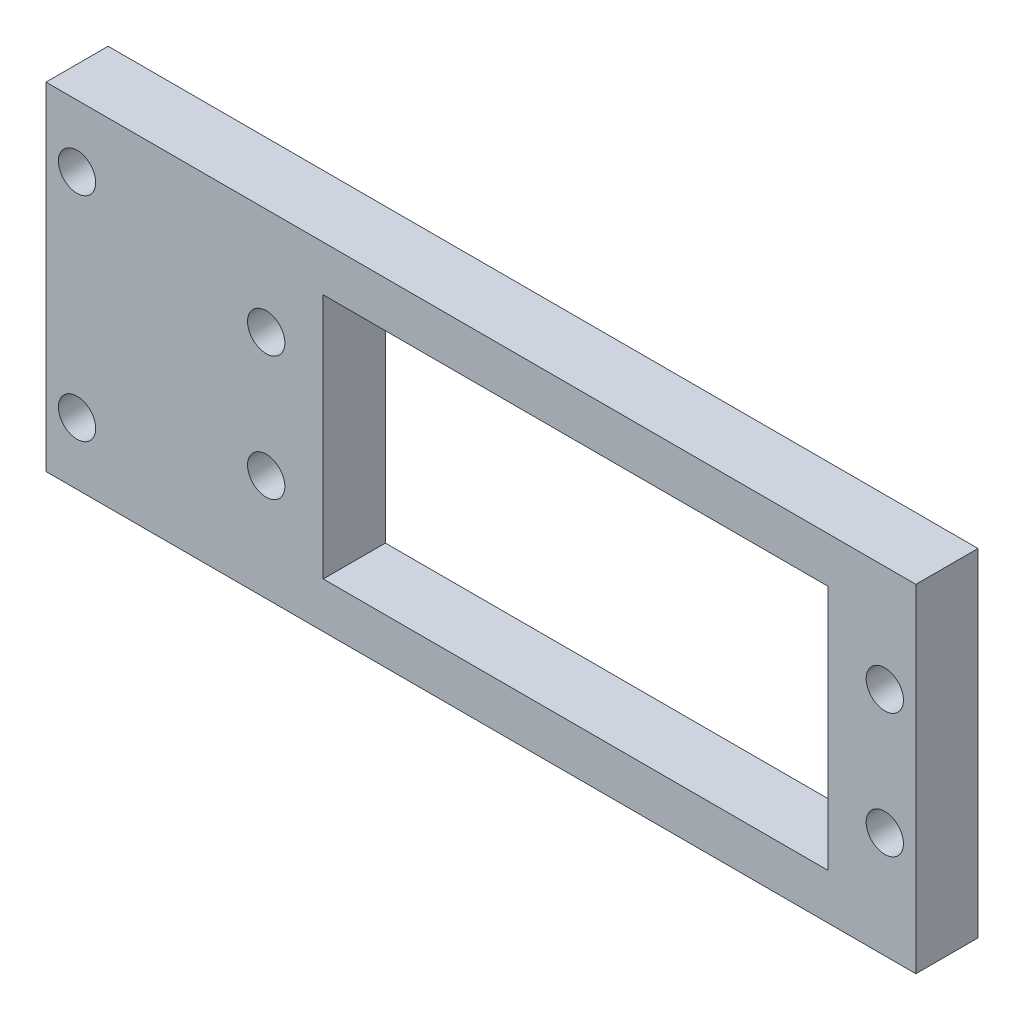
ISO-10303-21;
HEADER;
FILE_DESCRIPTION(('STEP AP214'),'2;1');
FILE_NAME('part.step','',(''),(''),'','','');
FILE_SCHEMA(('AUTOMOTIVE_DESIGN { 1 0 10303 214 1 1 1 1 }'));
ENDSEC;
DATA;
#1=APPLICATION_CONTEXT('core data for automotive mechanical design processes');
#2=APPLICATION_PROTOCOL_DEFINITION('international standard','automotive_design',2000,#1);
#3=PRODUCT_CONTEXT('',#1,'mechanical');
#4=PRODUCT('Part','Part','',(#3));
#5=PRODUCT_RELATED_PRODUCT_CATEGORY('part','',(#4));
#6=PRODUCT_DEFINITION_FORMATION('','',#4);
#7=PRODUCT_DEFINITION_CONTEXT('part definition',#1,'design');
#8=PRODUCT_DEFINITION('design','',#6,#7);
#9=PRODUCT_DEFINITION_SHAPE('','',#8);
#10=(LENGTH_UNIT() NAMED_UNIT(*) SI_UNIT(.MILLI.,.METRE.));
#11=(NAMED_UNIT(*) PLANE_ANGLE_UNIT() SI_UNIT($,.RADIAN.));
#12=(NAMED_UNIT(*) SI_UNIT($,.STERADIAN.) SOLID_ANGLE_UNIT());
#13=UNCERTAINTY_MEASURE_WITH_UNIT(LENGTH_MEASURE(1.E-05),#10,'distance_accuracy_value','');
#14=(GEOMETRIC_REPRESENTATION_CONTEXT(3) GLOBAL_UNCERTAINTY_ASSIGNED_CONTEXT((#13)) GLOBAL_UNIT_ASSIGNED_CONTEXT((#10,
#11,#12)) REPRESENTATION_CONTEXT('',''));
#15=CARTESIAN_POINT('',(0.,0.,0.));
#16=DIRECTION('',(0.,0.,1.));
#17=DIRECTION('',(1.,0.,0.));
#18=AXIS2_PLACEMENT_3D('',#15,#16,#17);
#19=CARTESIAN_POINT('',(-26.750512878014,19.6766169154229,5.));
#20=DIRECTION('',(1.,0.,0.));
#21=DIRECTION('',(0.,1.,0.));
#22=AXIS2_PLACEMENT_3D('',#19,#20,#21);
#23=PLANE('',#22);
#24=DIRECTION('',(0.,-1.,0.));
#25=VECTOR('',#24,1.);
#26=CARTESIAN_POINT('',(-26.750512878014,19.6766169154229,0.));
#27=LINE('',#26,#25);
#28=CARTESIAN_POINT('',(-26.750512878014,19.6766169154229,0.));
#29=VERTEX_POINT('',#28);
#30=CARTESIAN_POINT('',(-26.7505128780139,-7.46338308457712,0.));
#31=VERTEX_POINT('',#30);
#32=EDGE_CURVE('E160',#29,#31,#27,.T.);
#33=ORIENTED_EDGE('',*,*,#32,.T.);
#34=DIRECTION('',(0.,0.,-1.));
#35=VECTOR('',#34,1.);
#36=CARTESIAN_POINT('',(-26.7505128780139,-7.46338308457712,5.));
#37=LINE('',#36,#35);
#38=CARTESIAN_POINT('',(-26.7505128780139,-7.46338308457712,5.));
#39=VERTEX_POINT('',#38);
#40=EDGE_CURVE('E11',#39,#31,#37,.T.);
#41=ORIENTED_EDGE('',*,*,#40,.F.);
#42=DIRECTION('',(0.,-1.,0.));
#43=VECTOR('',#42,1.);
#44=CARTESIAN_POINT('',(-26.750512878014,19.6766169154229,5.));
#45=LINE('',#44,#43);
#46=CARTESIAN_POINT('',(-26.750512878014,19.6766169154229,5.));
#47=VERTEX_POINT('',#46);
#48=EDGE_CURVE('E163',#47,#39,#45,.T.);
#49=ORIENTED_EDGE('',*,*,#48,.F.);
#50=DIRECTION('',(0.,0.,-1.));
#51=VECTOR('',#50,1.);
#52=CARTESIAN_POINT('',(-26.750512878014,19.6766169154229,5.));
#53=LINE('',#52,#51);
#54=EDGE_CURVE('E173',#47,#29,#53,.T.);
#55=ORIENTED_EDGE('',*,*,#54,.T.);
#56=EDGE_LOOP('',(#33,#41,#49,#55));
#57=FACE_BOUND('',#56,.T.);
#58=ADVANCED_FACE('F34',(#57),#23,.F.);
#59=CARTESIAN_POINT('',(-26.7505128780139,-7.46338308457712,5.));
#60=DIRECTION('',(0.,1.,0.));
#61=DIRECTION('',(0.,0.,1.));
#62=AXIS2_PLACEMENT_3D('',#59,#60,#61);
#63=PLANE('',#62);
#64=DIRECTION('',(1.,0.,0.));
#65=VECTOR('',#64,1.);
#66=CARTESIAN_POINT('',(-26.7505128780139,-7.46338308457712,0.));
#67=LINE('',#66,#65);
#68=CARTESIAN_POINT('',(43.249487121986,-7.46338308457712,0.));
#69=VERTEX_POINT('',#68);
#70=EDGE_CURVE('E176',#31,#69,#67,.T.);
#71=ORIENTED_EDGE('',*,*,#70,.T.);
#72=DIRECTION('',(0.,0.,-1.));
#73=VECTOR('',#72,1.);
#74=CARTESIAN_POINT('',(43.249487121986,-7.46338308457712,5.));
#75=LINE('',#74,#73);
#76=CARTESIAN_POINT('',(43.249487121986,-7.46338308457712,5.));
#77=VERTEX_POINT('',#76);
#78=EDGE_CURVE('E41',#77,#69,#75,.T.);
#79=ORIENTED_EDGE('',*,*,#78,.F.);
#80=DIRECTION('',(1.,0.,0.));
#81=VECTOR('',#80,1.);
#82=CARTESIAN_POINT('',(-26.7505128780139,-7.46338308457712,5.));
#83=LINE('',#82,#81);
#84=EDGE_CURVE('E166',#39,#77,#83,.T.);
#85=ORIENTED_EDGE('',*,*,#84,.F.);
#86=ORIENTED_EDGE('',*,*,#40,.T.);
#87=EDGE_LOOP('',(#71,#79,#85,#86));
#88=FACE_BOUND('',#87,.T.);
#89=ADVANCED_FACE('F205',(#88),#63,.F.);
#90=CARTESIAN_POINT('',(43.2494871219861,19.6766169154229,5.));
#91=DIRECTION('',(-1.,0.,0.));
#92=DIRECTION('',(0.,-1.,0.));
#93=AXIS2_PLACEMENT_3D('',#90,#91,#92);
#94=PLANE('',#93);
#95=DIRECTION('',(0.,1.,0.));
#96=VECTOR('',#95,1.);
#97=CARTESIAN_POINT('',(43.2494871219861,19.6766169154229,0.));
#98=LINE('',#97,#96);
#99=CARTESIAN_POINT('',(43.2494871219861,19.6766169154229,0.));
#100=VERTEX_POINT('',#99);
#101=EDGE_CURVE('E178',#69,#100,#98,.T.);
#102=ORIENTED_EDGE('',*,*,#101,.T.);
#103=DIRECTION('',(0.,0.,-1.));
#104=VECTOR('',#103,1.);
#105=CARTESIAN_POINT('',(43.2494871219861,19.6766169154229,5.));
#106=LINE('',#105,#104);
#107=CARTESIAN_POINT('',(43.2494871219861,19.6766169154229,5.));
#108=VERTEX_POINT('',#107);
#109=EDGE_CURVE('E183',#108,#100,#106,.T.);
#110=ORIENTED_EDGE('',*,*,#109,.F.);
#111=DIRECTION('',(0.,1.,0.));
#112=VECTOR('',#111,1.);
#113=CARTESIAN_POINT('',(43.2494871219861,19.6766169154229,5.));
#114=LINE('',#113,#112);
#115=EDGE_CURVE('E169',#77,#108,#114,.T.);
#116=ORIENTED_EDGE('',*,*,#115,.F.);
#117=ORIENTED_EDGE('',*,*,#78,.T.);
#118=EDGE_LOOP('',(#102,#110,#116,#117));
#119=FACE_BOUND('',#118,.T.);
#120=ADVANCED_FACE('F190',(#119),#94,.F.);
#121=CARTESIAN_POINT('',(-26.750512878014,19.6766169154229,5.));
#122=DIRECTION('',(0.,-1.,0.));
#123=DIRECTION('',(0.,0.,-1.));
#124=AXIS2_PLACEMENT_3D('',#121,#122,#123);
#125=PLANE('',#124);
#126=DIRECTION('',(-1.,0.,0.));
#127=VECTOR('',#126,1.);
#128=CARTESIAN_POINT('',(-26.750512878014,19.6766169154229,0.));
#129=LINE('',#128,#127);
#130=EDGE_CURVE('E167',#100,#29,#129,.T.);
#131=ORIENTED_EDGE('',*,*,#130,.T.);
#132=ORIENTED_EDGE('',*,*,#54,.F.);
#133=DIRECTION('',(-1.,0.,0.));
#134=VECTOR('',#133,1.);
#135=CARTESIAN_POINT('',(-26.750512878014,19.6766169154229,5.));
#136=LINE('',#135,#134);
#137=EDGE_CURVE('E171',#108,#47,#136,.T.);
#138=ORIENTED_EDGE('',*,*,#137,.F.);
#139=ORIENTED_EDGE('',*,*,#109,.T.);
#140=EDGE_LOOP('',(#131,#132,#138,#139));
#141=FACE_BOUND('',#140,.T.);
#142=ADVANCED_FACE('F199',(#141),#125,.F.);
#143=CARTESIAN_POINT('',(0.,0.,5.));
#144=DIRECTION('',(0.,0.,1.));
#145=DIRECTION('',(1.,0.,0.));
#146=AXIS2_PLACEMENT_3D('',#143,#144,#145);
#147=PLANE('',#146);
#148=CARTESIAN_POINT('',(-9.03051287801395,11.1066169154229,5.));
#149=DIRECTION('',(0.,0.,-1.));
#150=DIRECTION('',(-1.,0.,0.));
#151=AXIS2_PLACEMENT_3D('',#148,#149,#150);
#152=CIRCLE('',#151,1.5);
#153=CARTESIAN_POINT('',(-10.530512878014,11.1066169154229,5.));
#154=VERTEX_POINT('',#153);
#155=EDGE_CURVE('E260',#154,#154,#152,.T.);
#156=ORIENTED_EDGE('',*,*,#155,.T.);
#157=EDGE_LOOP('',(#156));
#158=FACE_BOUND('',#157,.T.);
#159=CARTESIAN_POINT('',(-9.03051287801395,1.10661691542288,5.));
#160=DIRECTION('',(0.,0.,-1.));
#161=DIRECTION('',(-1.,0.,0.));
#162=AXIS2_PLACEMENT_3D('',#159,#160,#161);
#163=CIRCLE('',#162,1.5);
#164=CARTESIAN_POINT('',(-10.530512878014,1.10661691542288,5.));
#165=VERTEX_POINT('',#164);
#166=EDGE_CURVE('E129',#165,#165,#163,.T.);
#167=ORIENTED_EDGE('',*,*,#166,.T.);
#168=EDGE_LOOP('',(#167));
#169=FACE_BOUND('',#168,.T.);
#170=DIRECTION('',(0.,-1.,0.));
#171=VECTOR('',#170,1.);
#172=CARTESIAN_POINT('',(36.1594871219861,-3.79338308457712,5.));
#173=LINE('',#172,#171);
#174=CARTESIAN_POINT('',(36.1594871219861,16.0066169154229,5.));
#175=VERTEX_POINT('',#174);
#176=CARTESIAN_POINT('',(36.1594871219861,-3.79338308457712,5.));
#177=VERTEX_POINT('',#176);
#178=EDGE_CURVE('E100',#175,#177,#173,.T.);
#179=ORIENTED_EDGE('',*,*,#178,.T.);
#180=DIRECTION('',(-1.,0.,0.));
#181=VECTOR('',#180,1.);
#182=CARTESIAN_POINT('',(36.1594871219861,-3.79338308457712,5.));
#183=LINE('',#182,#181);
#184=CARTESIAN_POINT('',(-4.44051287801395,-3.79338308457712,5.));
#185=VERTEX_POINT('',#184);
#186=EDGE_CURVE('E109',#177,#185,#183,.T.);
#187=ORIENTED_EDGE('',*,*,#186,.T.);
#188=DIRECTION('',(0.,1.,0.));
#189=VECTOR('',#188,1.);
#190=CARTESIAN_POINT('',(-4.44051287801395,-3.79338308457712,5.));
#191=LINE('',#190,#189);
#192=CARTESIAN_POINT('',(-4.44051287801395,16.0066169154229,5.));
#193=VERTEX_POINT('',#192);
#194=EDGE_CURVE('E48',#185,#193,#191,.T.);
#195=ORIENTED_EDGE('',*,*,#194,.T.);
#196=DIRECTION('',(1.,0.,0.));
#197=VECTOR('',#196,1.);
#198=CARTESIAN_POINT('',(36.1594871219861,16.0066169154229,5.));
#199=LINE('',#198,#197);
#200=EDGE_CURVE('E106',#193,#175,#199,.T.);
#201=ORIENTED_EDGE('',*,*,#200,.T.);
#202=EDGE_LOOP('',(#179,#187,#195,#201));
#203=FACE_BOUND('',#202,.T.);
#204=CARTESIAN_POINT('',(-24.250512878014,-2.46338308457712,5.));
#205=DIRECTION('',(0.,0.,1.));
#206=DIRECTION('',(1.,0.,0.));
#207=AXIS2_PLACEMENT_3D('',#204,#205,#206);
#208=CIRCLE('',#207,1.5);
#209=CARTESIAN_POINT('',(-22.750512878014,-2.46338308457712,5.));
#210=VERTEX_POINT('',#209);
#211=EDGE_CURVE('E143',#210,#210,#208,.T.);
#212=ORIENTED_EDGE('',*,*,#211,.F.);
#213=EDGE_LOOP('',(#212));
#214=FACE_BOUND('',#213,.T.);
#215=CARTESIAN_POINT('',(40.749487121986,11.1066169154229,5.));
#216=DIRECTION('',(0.,0.,1.));
#217=DIRECTION('',(1.,0.,0.));
#218=AXIS2_PLACEMENT_3D('',#215,#216,#217);
#219=CIRCLE('',#218,1.5);
#220=CARTESIAN_POINT('',(42.249487121986,11.1066169154229,5.));
#221=VERTEX_POINT('',#220);
#222=EDGE_CURVE('E149',#221,#221,#219,.T.);
#223=ORIENTED_EDGE('',*,*,#222,.F.);
#224=EDGE_LOOP('',(#223));
#225=FACE_BOUND('',#224,.T.);
#226=CARTESIAN_POINT('',(40.749487121986,1.10661691542288,5.));
#227=DIRECTION('',(0.,0.,1.));
#228=DIRECTION('',(1.,0.,0.));
#229=AXIS2_PLACEMENT_3D('',#226,#227,#228);
#230=CIRCLE('',#229,1.5);
#231=CARTESIAN_POINT('',(42.249487121986,1.10661691542288,5.));
#232=VERTEX_POINT('',#231);
#233=EDGE_CURVE('E135',#232,#232,#230,.T.);
#234=ORIENTED_EDGE('',*,*,#233,.F.);
#235=EDGE_LOOP('',(#234));
#236=FACE_BOUND('',#235,.T.);
#237=CARTESIAN_POINT('',(-24.2505128780139,14.6766169154229,5.));
#238=DIRECTION('',(0.,0.,1.));
#239=DIRECTION('',(1.,0.,0.));
#240=AXIS2_PLACEMENT_3D('',#237,#238,#239);
#241=CIRCLE('',#240,1.5);
#242=CARTESIAN_POINT('',(-22.7505128780139,14.6766169154229,5.));
#243=VERTEX_POINT('',#242);
#244=EDGE_CURVE('E142',#243,#243,#241,.T.);
#245=ORIENTED_EDGE('',*,*,#244,.F.);
#246=EDGE_LOOP('',(#245));
#247=FACE_BOUND('',#246,.T.);
#248=ORIENTED_EDGE('',*,*,#48,.T.);
#249=ORIENTED_EDGE('',*,*,#84,.T.);
#250=ORIENTED_EDGE('',*,*,#115,.T.);
#251=ORIENTED_EDGE('',*,*,#137,.T.);
#252=EDGE_LOOP('',(#248,#249,#250,#251));
#253=FACE_BOUND('',#252,.T.);
#254=ADVANCED_FACE('F113',(#158,#169,#203,#214,#225,#236,#247,#253),#147,.T.);
#255=CARTESIAN_POINT('',(0.,0.,0.));
#256=DIRECTION('',(0.,0.,1.));
#257=DIRECTION('',(1.,0.,0.));
#258=AXIS2_PLACEMENT_3D('',#255,#256,#257);
#259=PLANE('',#258);
#260=CARTESIAN_POINT('',(-9.03051287801395,11.1066169154229,0.));
#261=DIRECTION('',(0.,0.,-1.));
#262=DIRECTION('',(-1.,0.,0.));
#263=AXIS2_PLACEMENT_3D('',#260,#261,#262);
#264=CIRCLE('',#263,1.5);
#265=CARTESIAN_POINT('',(-10.530512878014,11.1066169154229,0.));
#266=VERTEX_POINT('',#265);
#267=EDGE_CURVE('E263',#266,#266,#264,.T.);
#268=ORIENTED_EDGE('',*,*,#267,.F.);
#269=EDGE_LOOP('',(#268));
#270=FACE_BOUND('',#269,.T.);
#271=CARTESIAN_POINT('',(-9.03051287801395,1.10661691542288,0.));
#272=DIRECTION('',(0.,0.,-1.));
#273=DIRECTION('',(-1.,0.,0.));
#274=AXIS2_PLACEMENT_3D('',#271,#272,#273);
#275=CIRCLE('',#274,1.5);
#276=CARTESIAN_POINT('',(-10.530512878014,1.10661691542288,0.));
#277=VERTEX_POINT('',#276);
#278=EDGE_CURVE('E122',#277,#277,#275,.T.);
#279=ORIENTED_EDGE('',*,*,#278,.F.);
#280=EDGE_LOOP('',(#279));
#281=FACE_BOUND('',#280,.T.);
#282=DIRECTION('',(-1.,0.,0.));
#283=VECTOR('',#282,1.);
#284=CARTESIAN_POINT('',(36.1594871219861,-3.79338308457712,0.));
#285=LINE('',#284,#283);
#286=CARTESIAN_POINT('',(36.1594871219861,-3.79338308457712,0.));
#287=VERTEX_POINT('',#286);
#288=CARTESIAN_POINT('',(-4.44051287801395,-3.79338308457712,0.));
#289=VERTEX_POINT('',#288);
#290=EDGE_CURVE('E128',#287,#289,#285,.T.);
#291=ORIENTED_EDGE('',*,*,#290,.F.);
#292=DIRECTION('',(0.,-1.,0.));
#293=VECTOR('',#292,1.);
#294=CARTESIAN_POINT('',(36.1594871219861,-3.79338308457712,0.));
#295=LINE('',#294,#293);
#296=CARTESIAN_POINT('',(36.1594871219861,16.0066169154229,0.));
#297=VERTEX_POINT('',#296);
#298=EDGE_CURVE('E56',#297,#287,#295,.T.);
#299=ORIENTED_EDGE('',*,*,#298,.F.);
#300=DIRECTION('',(1.,0.,0.));
#301=VECTOR('',#300,1.);
#302=CARTESIAN_POINT('',(36.1594871219861,16.0066169154229,0.));
#303=LINE('',#302,#301);
#304=CARTESIAN_POINT('',(-4.44051287801395,16.0066169154229,0.));
#305=VERTEX_POINT('',#304);
#306=EDGE_CURVE('E116',#305,#297,#303,.T.);
#307=ORIENTED_EDGE('',*,*,#306,.F.);
#308=DIRECTION('',(0.,1.,0.));
#309=VECTOR('',#308,1.);
#310=CARTESIAN_POINT('',(-4.44051287801395,-3.79338308457712,0.));
#311=LINE('',#310,#309);
#312=EDGE_CURVE('E119',#289,#305,#311,.T.);
#313=ORIENTED_EDGE('',*,*,#312,.F.);
#314=EDGE_LOOP('',(#291,#299,#307,#313));
#315=FACE_BOUND('',#314,.T.);
#316=CARTESIAN_POINT('',(-24.250512878014,-2.46338308457712,0.));
#317=DIRECTION('',(0.,0.,1.));
#318=DIRECTION('',(1.,0.,0.));
#319=AXIS2_PLACEMENT_3D('',#316,#317,#318);
#320=CIRCLE('',#319,1.5);
#321=CARTESIAN_POINT('',(-22.750512878014,-2.46338308457712,0.));
#322=VERTEX_POINT('',#321);
#323=EDGE_CURVE('E139',#322,#322,#320,.T.);
#324=ORIENTED_EDGE('',*,*,#323,.T.);
#325=EDGE_LOOP('',(#324));
#326=FACE_BOUND('',#325,.T.);
#327=CARTESIAN_POINT('',(40.749487121986,11.1066169154229,0.));
#328=DIRECTION('',(0.,0.,1.));
#329=DIRECTION('',(1.,0.,0.));
#330=AXIS2_PLACEMENT_3D('',#327,#328,#329);
#331=CIRCLE('',#330,1.5);
#332=CARTESIAN_POINT('',(42.249487121986,11.1066169154229,0.));
#333=VERTEX_POINT('',#332);
#334=EDGE_CURVE('E146',#333,#333,#331,.T.);
#335=ORIENTED_EDGE('',*,*,#334,.T.);
#336=EDGE_LOOP('',(#335));
#337=FACE_BOUND('',#336,.T.);
#338=CARTESIAN_POINT('',(40.749487121986,1.10661691542288,0.));
#339=DIRECTION('',(0.,0.,1.));
#340=DIRECTION('',(1.,0.,0.));
#341=AXIS2_PLACEMENT_3D('',#338,#339,#340);
#342=CIRCLE('',#341,1.5);
#343=CARTESIAN_POINT('',(42.249487121986,1.10661691542288,0.));
#344=VERTEX_POINT('',#343);
#345=EDGE_CURVE('E152',#344,#344,#342,.T.);
#346=ORIENTED_EDGE('',*,*,#345,.T.);
#347=EDGE_LOOP('',(#346));
#348=FACE_BOUND('',#347,.T.);
#349=CARTESIAN_POINT('',(-24.2505128780139,14.6766169154229,0.));
#350=DIRECTION('',(0.,0.,1.));
#351=DIRECTION('',(1.,0.,0.));
#352=AXIS2_PLACEMENT_3D('',#349,#350,#351);
#353=CIRCLE('',#352,1.5);
#354=CARTESIAN_POINT('',(-22.7505128780139,14.6766169154229,0.));
#355=VERTEX_POINT('',#354);
#356=EDGE_CURVE('E157',#355,#355,#353,.T.);
#357=ORIENTED_EDGE('',*,*,#356,.T.);
#358=EDGE_LOOP('',(#357));
#359=FACE_BOUND('',#358,.T.);
#360=ORIENTED_EDGE('',*,*,#32,.F.);
#361=ORIENTED_EDGE('',*,*,#130,.F.);
#362=ORIENTED_EDGE('',*,*,#101,.F.);
#363=ORIENTED_EDGE('',*,*,#70,.F.);
#364=EDGE_LOOP('',(#360,#361,#362,#363));
#365=FACE_BOUND('',#364,.T.);
#366=ADVANCED_FACE('F196',(#270,#281,#315,#326,#337,#348,#359,#365),#259,.F.);
#367=CARTESIAN_POINT('',(-24.2505128780139,14.6766169154229,0.));
#368=DIRECTION('',(0.,0.,1.));
#369=DIRECTION('',(1.,0.,0.));
#370=AXIS2_PLACEMENT_3D('',#367,#368,#369);
#371=CYLINDRICAL_SURFACE('',#370,1.5);
#372=ORIENTED_EDGE('',*,*,#356,.F.);
#373=EDGE_LOOP('',(#372));
#374=FACE_BOUND('',#373,.T.);
#375=ORIENTED_EDGE('',*,*,#244,.T.);
#376=EDGE_LOOP('',(#375));
#377=FACE_BOUND('',#376,.T.);
#378=ADVANCED_FACE('F217',(#374,#377),#371,.F.);
#379=CARTESIAN_POINT('',(40.749487121986,1.10661691542288,0.));
#380=DIRECTION('',(0.,0.,1.));
#381=DIRECTION('',(1.,0.,0.));
#382=AXIS2_PLACEMENT_3D('',#379,#380,#381);
#383=CYLINDRICAL_SURFACE('',#382,1.5);
#384=ORIENTED_EDGE('',*,*,#345,.F.);
#385=EDGE_LOOP('',(#384));
#386=FACE_BOUND('',#385,.T.);
#387=ORIENTED_EDGE('',*,*,#233,.T.);
#388=EDGE_LOOP('',(#387));
#389=FACE_BOUND('',#388,.T.);
#390=ADVANCED_FACE('F224',(#386,#389),#383,.F.);
#391=CARTESIAN_POINT('',(40.749487121986,11.1066169154229,0.));
#392=DIRECTION('',(0.,0.,1.));
#393=DIRECTION('',(1.,0.,0.));
#394=AXIS2_PLACEMENT_3D('',#391,#392,#393);
#395=CYLINDRICAL_SURFACE('',#394,1.5);
#396=ORIENTED_EDGE('',*,*,#334,.F.);
#397=EDGE_LOOP('',(#396));
#398=FACE_BOUND('',#397,.T.);
#399=ORIENTED_EDGE('',*,*,#222,.T.);
#400=EDGE_LOOP('',(#399));
#401=FACE_BOUND('',#400,.T.);
#402=ADVANCED_FACE('F228',(#398,#401),#395,.F.);
#403=CARTESIAN_POINT('',(-24.250512878014,-2.46338308457712,0.));
#404=DIRECTION('',(0.,0.,1.));
#405=DIRECTION('',(1.,0.,0.));
#406=AXIS2_PLACEMENT_3D('',#403,#404,#405);
#407=CYLINDRICAL_SURFACE('',#406,1.5);
#408=ORIENTED_EDGE('',*,*,#323,.F.);
#409=EDGE_LOOP('',(#408));
#410=FACE_BOUND('',#409,.T.);
#411=ORIENTED_EDGE('',*,*,#211,.T.);
#412=EDGE_LOOP('',(#411));
#413=FACE_BOUND('',#412,.T.);
#414=ADVANCED_FACE('F232',(#410,#413),#407,.F.);
#415=CARTESIAN_POINT('',(36.1594871219861,-3.79338308457712,5.));
#416=DIRECTION('',(1.,0.,0.));
#417=DIRECTION('',(0.,0.,-1.));
#418=AXIS2_PLACEMENT_3D('',#415,#416,#417);
#419=PLANE('',#418);
#420=ORIENTED_EDGE('',*,*,#298,.T.);
#421=DIRECTION('',(0.,0.,-1.));
#422=VECTOR('',#421,1.);
#423=CARTESIAN_POINT('',(36.1594871219861,-3.79338308457712,5.));
#424=LINE('',#423,#422);
#425=EDGE_CURVE('E96',#177,#287,#424,.T.);
#426=ORIENTED_EDGE('',*,*,#425,.F.);
#427=ORIENTED_EDGE('',*,*,#178,.F.);
#428=DIRECTION('',(0.,0.,-1.));
#429=VECTOR('',#428,1.);
#430=CARTESIAN_POINT('',(36.1594871219861,16.0066169154229,5.));
#431=LINE('',#430,#429);
#432=EDGE_CURVE('E133',#175,#297,#431,.T.);
#433=ORIENTED_EDGE('',*,*,#432,.T.);
#434=EDGE_LOOP('',(#420,#426,#427,#433));
#435=FACE_BOUND('',#434,.T.);
#436=ADVANCED_FACE('F98',(#435),#419,.F.);
#437=CARTESIAN_POINT('',(36.1594871219861,16.0066169154229,5.));
#438=DIRECTION('',(0.,1.,0.));
#439=DIRECTION('',(0.,0.,1.));
#440=AXIS2_PLACEMENT_3D('',#437,#438,#439);
#441=PLANE('',#440);
#442=ORIENTED_EDGE('',*,*,#306,.T.);
#443=ORIENTED_EDGE('',*,*,#432,.F.);
#444=ORIENTED_EDGE('',*,*,#200,.F.);
#445=DIRECTION('',(0.,0.,-1.));
#446=VECTOR('',#445,1.);
#447=CARTESIAN_POINT('',(-4.44051287801395,16.0066169154229,5.));
#448=LINE('',#447,#446);
#449=EDGE_CURVE('E136',#193,#305,#448,.T.);
#450=ORIENTED_EDGE('',*,*,#449,.T.);
#451=EDGE_LOOP('',(#442,#443,#444,#450));
#452=FACE_BOUND('',#451,.T.);
#453=ADVANCED_FACE('F239',(#452),#441,.F.);
#454=CARTESIAN_POINT('',(-4.44051287801395,-3.79338308457712,5.));
#455=DIRECTION('',(-1.,0.,0.));
#456=DIRECTION('',(0.,0.,1.));
#457=AXIS2_PLACEMENT_3D('',#454,#455,#456);
#458=PLANE('',#457);
#459=ORIENTED_EDGE('',*,*,#312,.T.);
#460=ORIENTED_EDGE('',*,*,#449,.F.);
#461=ORIENTED_EDGE('',*,*,#194,.F.);
#462=DIRECTION('',(0.,0.,-1.));
#463=VECTOR('',#462,1.);
#464=CARTESIAN_POINT('',(-4.44051287801395,-3.79338308457712,5.));
#465=LINE('',#464,#463);
#466=EDGE_CURVE('E105',#185,#289,#465,.T.);
#467=ORIENTED_EDGE('',*,*,#466,.T.);
#468=EDGE_LOOP('',(#459,#460,#461,#467));
#469=FACE_BOUND('',#468,.T.);
#470=ADVANCED_FACE('F243',(#469),#458,.F.);
#471=CARTESIAN_POINT('',(36.1594871219861,-3.79338308457712,5.));
#472=DIRECTION('',(0.,-1.,0.));
#473=DIRECTION('',(0.,0.,-1.));
#474=AXIS2_PLACEMENT_3D('',#471,#472,#473);
#475=PLANE('',#474);
#476=ORIENTED_EDGE('',*,*,#290,.T.);
#477=ORIENTED_EDGE('',*,*,#466,.F.);
#478=ORIENTED_EDGE('',*,*,#186,.F.);
#479=ORIENTED_EDGE('',*,*,#425,.T.);
#480=EDGE_LOOP('',(#476,#477,#478,#479));
#481=FACE_BOUND('',#480,.T.);
#482=ADVANCED_FACE('F110',(#481),#475,.F.);
#483=CARTESIAN_POINT('',(-9.03051287801395,1.10661691542288,5.));
#484=DIRECTION('',(0.,0.,-1.));
#485=DIRECTION('',(-1.,0.,0.));
#486=AXIS2_PLACEMENT_3D('',#483,#484,#485);
#487=CYLINDRICAL_SURFACE('',#486,1.5);
#488=ORIENTED_EDGE('',*,*,#166,.F.);
#489=EDGE_LOOP('',(#488));
#490=FACE_BOUND('',#489,.T.);
#491=ORIENTED_EDGE('',*,*,#278,.T.);
#492=EDGE_LOOP('',(#491));
#493=FACE_BOUND('',#492,.T.);
#494=ADVANCED_FACE('F242',(#490,#493),#487,.F.);
#495=CARTESIAN_POINT('',(-9.03051287801395,11.1066169154229,5.));
#496=DIRECTION('',(0.,0.,-1.));
#497=DIRECTION('',(-1.,0.,0.));
#498=AXIS2_PLACEMENT_3D('',#495,#496,#497);
#499=CYLINDRICAL_SURFACE('',#498,1.5);
#500=ORIENTED_EDGE('',*,*,#155,.F.);
#501=EDGE_LOOP('',(#500));
#502=FACE_BOUND('',#501,.T.);
#503=ORIENTED_EDGE('',*,*,#267,.T.);
#504=EDGE_LOOP('',(#503));
#505=FACE_BOUND('',#504,.T.);
#506=ADVANCED_FACE('F251',(#502,#505),#499,.F.);
#507=CLOSED_SHELL('',(#58,#89,#120,#142,#254,#366,#378,#390,#402,#414,#436,#453,#470,#482,#494,#506));
#508=MANIFOLD_SOLID_BREP('B2',#507);
#509=ADVANCED_BREP_SHAPE_REPRESENTATION('',(#18,#508),#14);
#510=SHAPE_DEFINITION_REPRESENTATION(#9,#509);
ENDSEC;
END-ISO-10303-21;
